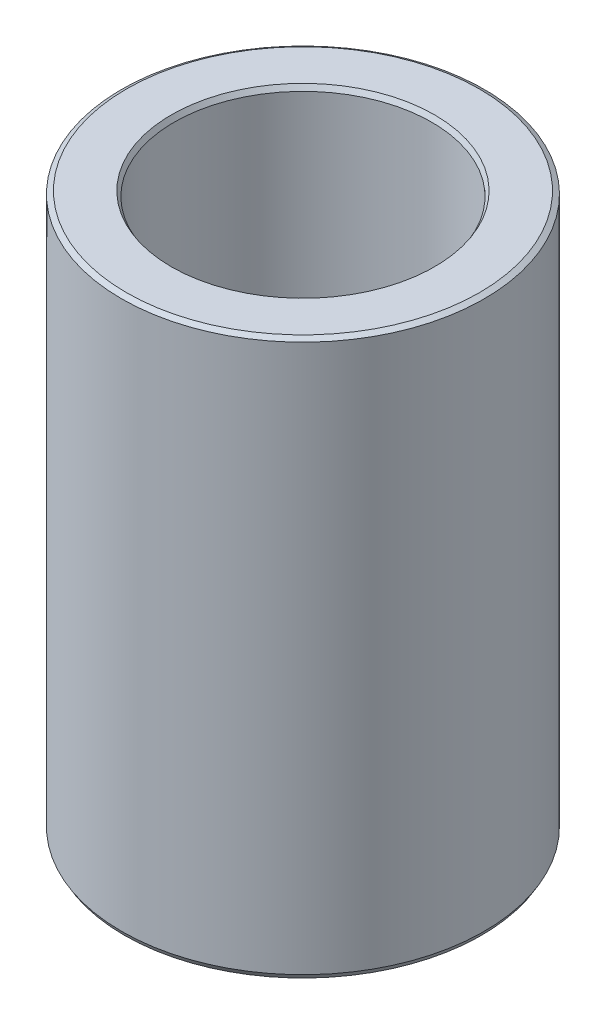
ISO-10303-21;
HEADER;
FILE_DESCRIPTION(('STEP AP214'),'2;1');
FILE_NAME('part.step','',(''),(''),'','','');
FILE_SCHEMA(('AUTOMOTIVE_DESIGN { 1 0 10303 214 1 1 1 1 }'));
ENDSEC;
DATA;
#1=APPLICATION_CONTEXT('core data for automotive mechanical design processes');
#2=APPLICATION_PROTOCOL_DEFINITION('international standard','automotive_design',2000,#1);
#3=PRODUCT_CONTEXT('',#1,'mechanical');
#4=PRODUCT('Part','Part','',(#3));
#5=PRODUCT_RELATED_PRODUCT_CATEGORY('part','',(#4));
#6=PRODUCT_DEFINITION_FORMATION('','',#4);
#7=PRODUCT_DEFINITION_CONTEXT('part definition',#1,'design');
#8=PRODUCT_DEFINITION('design','',#6,#7);
#9=PRODUCT_DEFINITION_SHAPE('','',#8);
#10=(LENGTH_UNIT() NAMED_UNIT(*) SI_UNIT(.MILLI.,.METRE.));
#11=(NAMED_UNIT(*) PLANE_ANGLE_UNIT() SI_UNIT($,.RADIAN.));
#12=(NAMED_UNIT(*) SI_UNIT($,.STERADIAN.) SOLID_ANGLE_UNIT());
#13=UNCERTAINTY_MEASURE_WITH_UNIT(LENGTH_MEASURE(1.E-05),#10,'distance_accuracy_value','');
#14=(GEOMETRIC_REPRESENTATION_CONTEXT(3) GLOBAL_UNCERTAINTY_ASSIGNED_CONTEXT((#13)) GLOBAL_UNIT_ASSIGNED_CONTEXT((#10,
#11,#12)) REPRESENTATION_CONTEXT('',''));
#15=CARTESIAN_POINT('',(0.,0.,0.));
#16=DIRECTION('',(0.,0.,1.));
#17=DIRECTION('',(1.,0.,0.));
#18=AXIS2_PLACEMENT_3D('',#15,#16,#17);
#19=CARTESIAN_POINT('',(0.,68.9120251913207,0.));
#20=DIRECTION('',(0.,-1.,0.));
#21=DIRECTION('',(0.,0.,-1.));
#22=AXIS2_PLACEMENT_3D('',#19,#20,#21);
#23=CYLINDRICAL_SURFACE('',#22,22.5);
#24=CARTESIAN_POINT('',(0.,0.611214075294089,0.));
#25=DIRECTION('',(0.,1.,0.));
#26=DIRECTION('',(0.,0.,1.));
#27=AXIS2_PLACEMENT_3D('',#24,#25,#26);
#28=CIRCLE('',#27,22.5);
#29=CARTESIAN_POINT('',(0.,0.611214075294089,22.5));
#30=VERTEX_POINT('',#29);
#31=EDGE_CURVE('E10',#30,#30,#28,.T.);
#32=ORIENTED_EDGE('',*,*,#31,.T.);
#33=EDGE_LOOP('',(#32));
#34=FACE_BOUND('',#33,.T.);
#35=CARTESIAN_POINT('',(0.,68.5591405804172,0.));
#36=DIRECTION('',(0.,1.,0.));
#37=DIRECTION('',(0.,0.,1.));
#38=AXIS2_PLACEMENT_3D('',#35,#36,#37);
#39=CIRCLE('',#38,22.5);
#40=CARTESIAN_POINT('',(0.,68.5591405804172,22.5));
#41=VERTEX_POINT('',#40);
#42=EDGE_CURVE('E50',#41,#41,#39,.F.);
#43=ORIENTED_EDGE('',*,*,#42,.T.);
#44=EDGE_LOOP('',(#43));
#45=FACE_BOUND('',#44,.T.);
#46=ADVANCED_FACE('F39',(#34,#45),#23,.T.);
#47=CARTESIAN_POINT('',(0.,68.9120251913207,0.));
#48=DIRECTION('',(0.,1.,0.));
#49=DIRECTION('',(0.,0.,1.));
#50=AXIS2_PLACEMENT_3D('',#47,#48,#49);
#51=PLANE('',#50);
#52=CARTESIAN_POINT('',(0.,68.9120251913207,0.));
#53=DIRECTION('',(0.,1.,0.));
#54=DIRECTION('',(0.,0.,1.));
#55=AXIS2_PLACEMENT_3D('',#52,#53,#54);
#56=CIRCLE('',#55,16.3285468625657);
#57=CARTESIAN_POINT('',(0.,68.9120251913207,16.3285468625657));
#58=VERTEX_POINT('',#57);
#59=EDGE_CURVE('E58',#58,#58,#56,.F.);
#60=ORIENTED_EDGE('',*,*,#59,.T.);
#61=EDGE_LOOP('',(#60));
#62=FACE_BOUND('',#61,.T.);
#63=CARTESIAN_POINT('',(0.,68.9120251913207,0.));
#64=DIRECTION('',(0.,1.,0.));
#65=DIRECTION('',(0.,0.,1.));
#66=AXIS2_PLACEMENT_3D('',#63,#64,#65);
#67=CIRCLE('',#66,21.8887859247059);
#68=CARTESIAN_POINT('',(0.,68.9120251913207,21.8887859247059));
#69=VERTEX_POINT('',#68);
#70=EDGE_CURVE('E61',#69,#69,#67,.T.);
#71=ORIENTED_EDGE('',*,*,#70,.T.);
#72=EDGE_LOOP('',(#71));
#73=FACE_BOUND('',#72,.T.);
#74=ADVANCED_FACE('F88',(#62,#73),#51,.T.);
#75=CARTESIAN_POINT('',(0.,0.,0.));
#76=DIRECTION('',(0.,1.,0.));
#77=DIRECTION('',(0.,0.,1.));
#78=AXIS2_PLACEMENT_3D('',#75,#76,#77);
#79=PLANE('',#78);
#80=CARTESIAN_POINT('',(0.,0.,0.));
#81=DIRECTION('',(0.,1.,0.));
#82=DIRECTION('',(0.,0.,1.));
#83=AXIS2_PLACEMENT_3D('',#80,#81,#82);
#84=CIRCLE('',#83,16.5868763269563);
#85=CARTESIAN_POINT('',(0.,0.,16.5868763269563));
#86=VERTEX_POINT('',#85);
#87=EDGE_CURVE('E51',#86,#86,#84,.T.);
#88=ORIENTED_EDGE('',*,*,#87,.T.);
#89=EDGE_LOOP('',(#88));
#90=FACE_BOUND('',#89,.T.);
#91=CARTESIAN_POINT('',(0.,0.,0.));
#92=DIRECTION('',(0.,1.,0.));
#93=DIRECTION('',(0.,0.,1.));
#94=AXIS2_PLACEMENT_3D('',#91,#92,#93);
#95=CIRCLE('',#94,22.1471153890965);
#96=CARTESIAN_POINT('',(0.,0.,22.1471153890965));
#97=VERTEX_POINT('',#96);
#98=EDGE_CURVE('E54',#97,#97,#95,.F.);
#99=ORIENTED_EDGE('',*,*,#98,.T.);
#100=EDGE_LOOP('',(#99));
#101=FACE_BOUND('',#100,.T.);
#102=ADVANCED_FACE('F83',(#90,#101),#79,.F.);
#103=CARTESIAN_POINT('',(0.,68.9120251913207,0.));
#104=DIRECTION('',(0.,-1.,0.));
#105=DIRECTION('',(0.,0.,-1.));
#106=AXIS2_PLACEMENT_3D('',#103,#104,#105);
#107=CYLINDRICAL_SURFACE('',#106,15.9756622516622);
#108=CARTESIAN_POINT('',(0.,68.3008111160266,0.));
#109=DIRECTION('',(0.,1.,0.));
#110=DIRECTION('',(0.,0.,1.));
#111=AXIS2_PLACEMENT_3D('',#108,#109,#110);
#112=CIRCLE('',#111,15.9756622516622);
#113=CARTESIAN_POINT('',(0.,68.3008111160266,15.9756622516622));
#114=VERTEX_POINT('',#113);
#115=EDGE_CURVE('E67',#114,#114,#112,.T.);
#116=ORIENTED_EDGE('',*,*,#115,.T.);
#117=EDGE_LOOP('',(#116));
#118=FACE_BOUND('',#117,.T.);
#119=CARTESIAN_POINT('',(0.,0.35288461090352,0.));
#120=DIRECTION('',(0.,1.,0.));
#121=DIRECTION('',(0.,0.,1.));
#122=AXIS2_PLACEMENT_3D('',#119,#120,#121);
#123=CIRCLE('',#122,15.9756622516622);
#124=CARTESIAN_POINT('',(0.,0.35288461090352,15.9756622516622));
#125=VERTEX_POINT('',#124);
#126=EDGE_CURVE('E69',#125,#125,#123,.F.);
#127=ORIENTED_EDGE('',*,*,#126,.T.);
#128=EDGE_LOOP('',(#127));
#129=FACE_BOUND('',#128,.T.);
#130=ADVANCED_FACE('F71',(#118,#129),#107,.F.);
#131=CARTESIAN_POINT('',(0.,68.3008111160266,0.));
#132=DIRECTION('',(0.,1.,0.));
#133=DIRECTION('',(0.,0.,1.));
#134=AXIS2_PLACEMENT_3D('',#131,#132,#133);
#135=CONICAL_SURFACE('',#134,15.9756622516622,0.523598775598296);
#136=ORIENTED_EDGE('',*,*,#59,.F.);
#137=EDGE_LOOP('',(#136));
#138=FACE_BOUND('',#137,.T.);
#139=ORIENTED_EDGE('',*,*,#115,.F.);
#140=EDGE_LOOP('',(#139));
#141=FACE_BOUND('',#140,.T.);
#142=ADVANCED_FACE('F77',(#138,#141),#135,.F.);
#143=CARTESIAN_POINT('',(0.,0.,0.));
#144=DIRECTION('',(0.,-1.,0.));
#145=DIRECTION('',(0.,0.,-1.));
#146=AXIS2_PLACEMENT_3D('',#143,#144,#145);
#147=CONICAL_SURFACE('',#146,16.5868763269563,1.0471975511966);
#148=ORIENTED_EDGE('',*,*,#126,.F.);
#149=EDGE_LOOP('',(#148));
#150=FACE_BOUND('',#149,.T.);
#151=ORIENTED_EDGE('',*,*,#87,.F.);
#152=EDGE_LOOP('',(#151));
#153=FACE_BOUND('',#152,.T.);
#154=ADVANCED_FACE('F73',(#150,#153),#147,.F.);
#155=CARTESIAN_POINT('',(0.,0.611214075294089,0.));
#156=DIRECTION('',(0.,1.,0.));
#157=DIRECTION('',(0.,0.,1.));
#158=AXIS2_PLACEMENT_3D('',#155,#156,#157);
#159=CONICAL_SURFACE('',#158,22.5,0.523598775598299);
#160=ORIENTED_EDGE('',*,*,#98,.F.);
#161=EDGE_LOOP('',(#160));
#162=FACE_BOUND('',#161,.T.);
#163=ORIENTED_EDGE('',*,*,#31,.F.);
#164=EDGE_LOOP('',(#163));
#165=FACE_BOUND('',#164,.T.);
#166=ADVANCED_FACE('F76',(#162,#165),#159,.T.);
#167=CARTESIAN_POINT('',(0.,68.9120251913207,0.));
#168=DIRECTION('',(0.,-1.,0.));
#169=DIRECTION('',(0.,0.,-1.));
#170=AXIS2_PLACEMENT_3D('',#167,#168,#169);
#171=CONICAL_SURFACE('',#170,21.8887859247059,1.0471975511966);
#172=ORIENTED_EDGE('',*,*,#42,.F.);
#173=EDGE_LOOP('',(#172));
#174=FACE_BOUND('',#173,.T.);
#175=ORIENTED_EDGE('',*,*,#70,.F.);
#176=EDGE_LOOP('',(#175));
#177=FACE_BOUND('',#176,.T.);
#178=ADVANCED_FACE('F45',(#174,#177),#171,.T.);
#179=CLOSED_SHELL('',(#46,#74,#102,#130,#142,#154,#166,#178));
#180=MANIFOLD_SOLID_BREP('B2',#179);
#181=ADVANCED_BREP_SHAPE_REPRESENTATION('',(#18,#180),#14);
#182=SHAPE_DEFINITION_REPRESENTATION(#9,#181);
ENDSEC;
END-ISO-10303-21;
